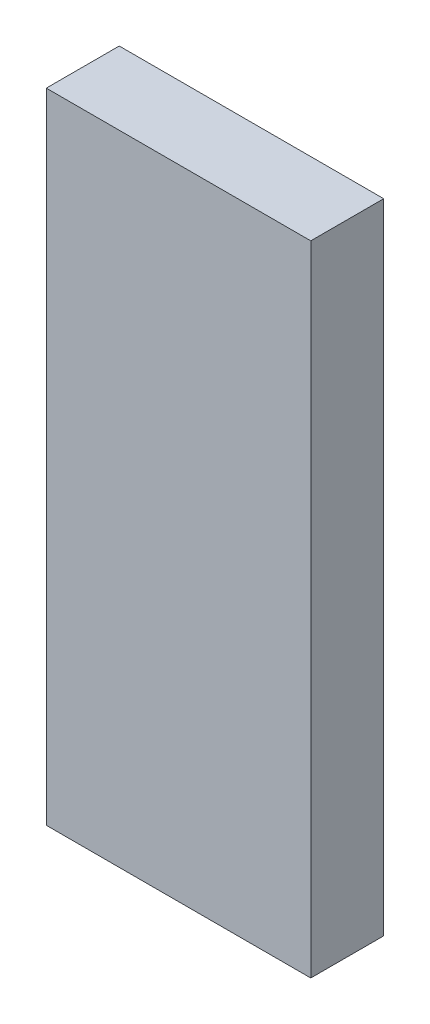
ISO-10303-21;
HEADER;
FILE_DESCRIPTION(('STEP AP214'),'2;1');
FILE_NAME('part.step','',(''),(''),'','','');
FILE_SCHEMA(('AUTOMOTIVE_DESIGN { 1 0 10303 214 1 1 1 1 }'));
ENDSEC;
DATA;
#1=APPLICATION_CONTEXT('core data for automotive mechanical design processes');
#2=APPLICATION_PROTOCOL_DEFINITION('international standard','automotive_design',2000,#1);
#3=PRODUCT_CONTEXT('',#1,'mechanical');
#4=PRODUCT('Part','Part','',(#3));
#5=PRODUCT_RELATED_PRODUCT_CATEGORY('part','',(#4));
#6=PRODUCT_DEFINITION_FORMATION('','',#4);
#7=PRODUCT_DEFINITION_CONTEXT('part definition',#1,'design');
#8=PRODUCT_DEFINITION('design','',#6,#7);
#9=PRODUCT_DEFINITION_SHAPE('','',#8);
#10=(LENGTH_UNIT() NAMED_UNIT(*) SI_UNIT(.MILLI.,.METRE.));
#11=(NAMED_UNIT(*) PLANE_ANGLE_UNIT() SI_UNIT($,.RADIAN.));
#12=(NAMED_UNIT(*) SI_UNIT($,.STERADIAN.) SOLID_ANGLE_UNIT());
#13=UNCERTAINTY_MEASURE_WITH_UNIT(LENGTH_MEASURE(1.E-05),#10,'distance_accuracy_value','');
#14=(GEOMETRIC_REPRESENTATION_CONTEXT(3) GLOBAL_UNCERTAINTY_ASSIGNED_CONTEXT((#13)) GLOBAL_UNIT_ASSIGNED_CONTEXT((#10,
#11,#12)) REPRESENTATION_CONTEXT('',''));
#15=CARTESIAN_POINT('',(0.,0.,0.));
#16=DIRECTION('',(0.,0.,1.));
#17=DIRECTION('',(1.,0.,0.));
#18=AXIS2_PLACEMENT_3D('',#15,#16,#17);
#19=CARTESIAN_POINT('',(0.,0.,0.2));
#20=DIRECTION('',(0.,0.,1.));
#21=DIRECTION('',(1.,0.,0.));
#22=AXIS2_PLACEMENT_3D('',#19,#20,#21);
#23=PLANE('',#22);
#24=DIRECTION('',(0.,1.,0.));
#25=VECTOR('',#24,1.);
#26=CARTESIAN_POINT('',(0.725,0.,0.2));
#27=LINE('',#26,#25);
#28=CARTESIAN_POINT('',(0.725,1.75,0.2));
#29=VERTEX_POINT('',#28);
#30=CARTESIAN_POINT('',(0.725,0.,0.2));
#31=VERTEX_POINT('',#30);
#32=EDGE_CURVE('E77',#29,#31,#27,.F.);
#33=ORIENTED_EDGE('',*,*,#32,.F.);
#34=DIRECTION('',(1.,0.,0.));
#35=VECTOR('',#34,1.);
#36=CARTESIAN_POINT('',(0.,1.75,0.2));
#37=LINE('',#36,#35);
#38=CARTESIAN_POINT('',(0.,1.75,0.2));
#39=VERTEX_POINT('',#38);
#40=EDGE_CURVE('E20',#29,#39,#37,.F.);
#41=ORIENTED_EDGE('',*,*,#40,.T.);
#42=DIRECTION('',(0.,1.,0.));
#43=VECTOR('',#42,1.);
#44=CARTESIAN_POINT('',(0.,0.,0.2));
#45=LINE('',#44,#43);
#46=CARTESIAN_POINT('',(0.,0.,0.2));
#47=VERTEX_POINT('',#46);
#48=EDGE_CURVE('E58',#39,#47,#45,.F.);
#49=ORIENTED_EDGE('',*,*,#48,.T.);
#50=DIRECTION('',(1.,0.,0.));
#51=VECTOR('',#50,1.);
#52=CARTESIAN_POINT('',(0.,0.,0.2));
#53=LINE('',#52,#51);
#54=EDGE_CURVE('E55',#47,#31,#53,.T.);
#55=ORIENTED_EDGE('',*,*,#54,.T.);
#56=EDGE_LOOP('',(#33,#41,#49,#55));
#57=FACE_BOUND('',#56,.T.);
#58=ADVANCED_FACE('F17',(#57),#23,.T.);
#59=CARTESIAN_POINT('',(0.,0.,0.));
#60=DIRECTION('',(1.,0.,0.));
#61=DIRECTION('',(0.,0.,-1.));
#62=AXIS2_PLACEMENT_3D('',#59,#60,#61);
#63=PLANE('',#62);
#64=DIRECTION('',(0.,0.,1.));
#65=VECTOR('',#64,1.);
#66=CARTESIAN_POINT('',(0.,1.75,0.));
#67=LINE('',#66,#65);
#68=CARTESIAN_POINT('',(0.,1.75,0.));
#69=VERTEX_POINT('',#68);
#70=EDGE_CURVE('E79',#69,#39,#67,.T.);
#71=ORIENTED_EDGE('',*,*,#70,.F.);
#72=DIRECTION('',(0.,1.,0.));
#73=VECTOR('',#72,1.);
#74=CARTESIAN_POINT('',(0.,0.,0.));
#75=LINE('',#74,#73);
#76=CARTESIAN_POINT('',(0.,0.,0.));
#77=VERTEX_POINT('',#76);
#78=EDGE_CURVE('E73',#69,#77,#75,.F.);
#79=ORIENTED_EDGE('',*,*,#78,.T.);
#80=DIRECTION('',(0.,0.,1.));
#81=VECTOR('',#80,1.);
#82=CARTESIAN_POINT('',(0.,0.,0.));
#83=LINE('',#82,#81);
#84=EDGE_CURVE('E63',#77,#47,#83,.T.);
#85=ORIENTED_EDGE('',*,*,#84,.T.);
#86=ORIENTED_EDGE('',*,*,#48,.F.);
#87=EDGE_LOOP('',(#71,#79,#85,#86));
#88=FACE_BOUND('',#87,.T.);
#89=ADVANCED_FACE('F72',(#88),#63,.F.);
#90=CARTESIAN_POINT('',(0.,0.,0.));
#91=DIRECTION('',(0.,1.,0.));
#92=DIRECTION('',(0.,0.,1.));
#93=AXIS2_PLACEMENT_3D('',#90,#91,#92);
#94=PLANE('',#93);
#95=ORIENTED_EDGE('',*,*,#54,.F.);
#96=ORIENTED_EDGE('',*,*,#84,.F.);
#97=DIRECTION('',(1.,0.,0.));
#98=VECTOR('',#97,1.);
#99=CARTESIAN_POINT('',(0.,0.,0.));
#100=LINE('',#99,#98);
#101=CARTESIAN_POINT('',(0.725,0.,0.));
#102=VERTEX_POINT('',#101);
#103=EDGE_CURVE('E83',#77,#102,#100,.T.);
#104=ORIENTED_EDGE('',*,*,#103,.T.);
#105=DIRECTION('',(0.,0.,-1.));
#106=VECTOR('',#105,1.);
#107=CARTESIAN_POINT('',(0.725,0.,0.));
#108=LINE('',#107,#106);
#109=EDGE_CURVE('E69',#31,#102,#108,.T.);
#110=ORIENTED_EDGE('',*,*,#109,.F.);
#111=EDGE_LOOP('',(#95,#96,#104,#110));
#112=FACE_BOUND('',#111,.T.);
#113=ADVANCED_FACE('F66',(#112),#94,.F.);
#114=CARTESIAN_POINT('',(0.725,0.,0.));
#115=DIRECTION('',(1.,0.,0.));
#116=DIRECTION('',(0.,0.,-1.));
#117=AXIS2_PLACEMENT_3D('',#114,#115,#116);
#118=PLANE('',#117);
#119=DIRECTION('',(0.,0.,1.));
#120=VECTOR('',#119,1.);
#121=CARTESIAN_POINT('',(0.725,1.75,0.));
#122=LINE('',#121,#120);
#123=CARTESIAN_POINT('',(0.725,1.75,0.));
#124=VERTEX_POINT('',#123);
#125=EDGE_CURVE('E34',#29,#124,#122,.F.);
#126=ORIENTED_EDGE('',*,*,#125,.F.);
#127=ORIENTED_EDGE('',*,*,#32,.T.);
#128=ORIENTED_EDGE('',*,*,#109,.T.);
#129=DIRECTION('',(0.,1.,0.));
#130=VECTOR('',#129,1.);
#131=CARTESIAN_POINT('',(0.725,0.,0.));
#132=LINE('',#131,#130);
#133=EDGE_CURVE('E26',#102,#124,#132,.T.);
#134=ORIENTED_EDGE('',*,*,#133,.T.);
#135=EDGE_LOOP('',(#126,#127,#128,#134));
#136=FACE_BOUND('',#135,.T.);
#137=ADVANCED_FACE('F88',(#136),#118,.T.);
#138=CARTESIAN_POINT('',(0.,1.75,0.));
#139=DIRECTION('',(0.,1.,0.));
#140=DIRECTION('',(0.,0.,1.));
#141=AXIS2_PLACEMENT_3D('',#138,#139,#140);
#142=PLANE('',#141);
#143=ORIENTED_EDGE('',*,*,#40,.F.);
#144=ORIENTED_EDGE('',*,*,#125,.T.);
#145=DIRECTION('',(1.,0.,0.));
#146=VECTOR('',#145,1.);
#147=CARTESIAN_POINT('',(0.,1.75,0.));
#148=LINE('',#147,#146);
#149=EDGE_CURVE('E11',#124,#69,#148,.F.);
#150=ORIENTED_EDGE('',*,*,#149,.T.);
#151=ORIENTED_EDGE('',*,*,#70,.T.);
#152=EDGE_LOOP('',(#143,#144,#150,#151));
#153=FACE_BOUND('',#152,.T.);
#154=ADVANCED_FACE('F91',(#153),#142,.T.);
#155=CARTESIAN_POINT('',(0.,0.,0.));
#156=DIRECTION('',(0.,0.,1.));
#157=DIRECTION('',(1.,0.,0.));
#158=AXIS2_PLACEMENT_3D('',#155,#156,#157);
#159=PLANE('',#158);
#160=ORIENTED_EDGE('',*,*,#133,.F.);
#161=ORIENTED_EDGE('',*,*,#103,.F.);
#162=ORIENTED_EDGE('',*,*,#78,.F.);
#163=ORIENTED_EDGE('',*,*,#149,.F.);
#164=EDGE_LOOP('',(#160,#161,#162,#163));
#165=FACE_BOUND('',#164,.T.);
#166=ADVANCED_FACE('F90',(#165),#159,.F.);
#167=CLOSED_SHELL('',(#58,#89,#113,#137,#154,#166));
#168=MANIFOLD_SOLID_BREP('B1',#167);
#169=ADVANCED_BREP_SHAPE_REPRESENTATION('',(#18,#168),#14);
#170=SHAPE_DEFINITION_REPRESENTATION(#9,#169);
ENDSEC;
END-ISO-10303-21;
